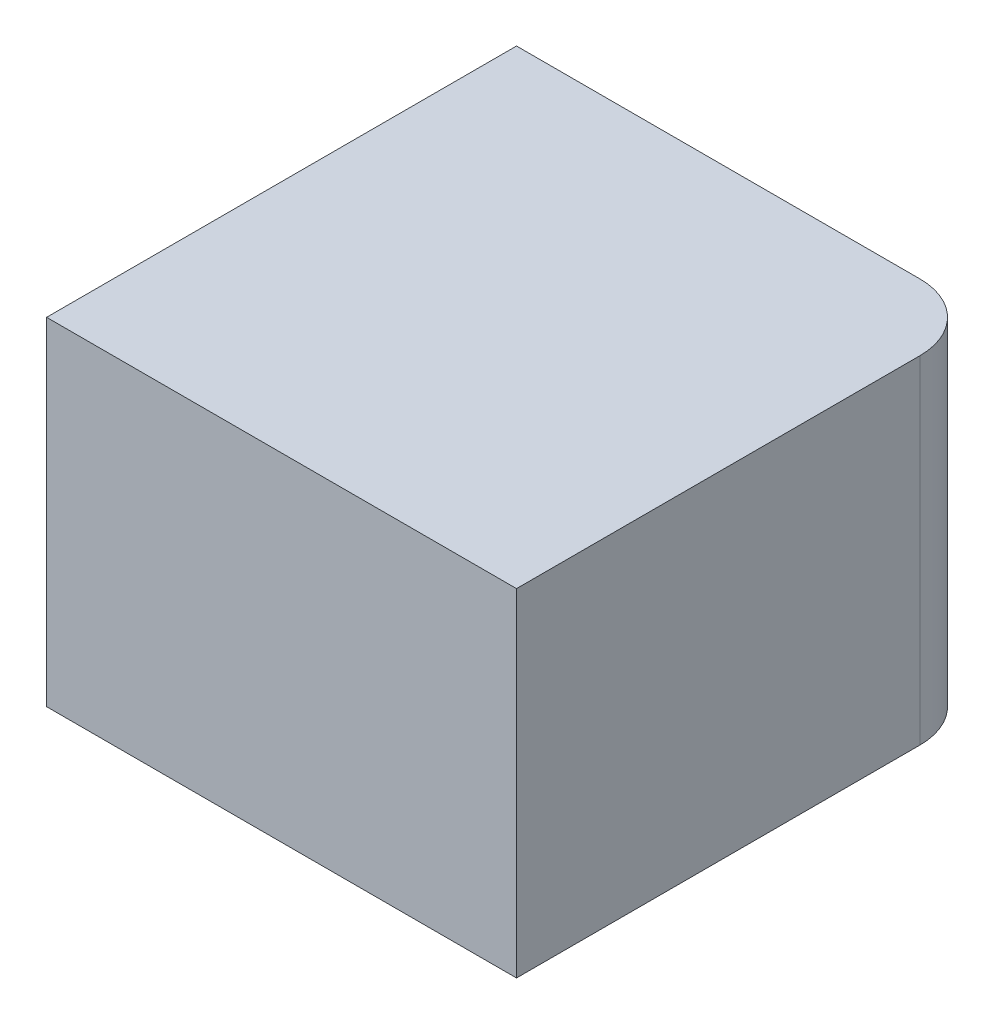
ISO-10303-21;
HEADER;
FILE_DESCRIPTION(('STEP AP214'),'2;1');
FILE_NAME('part.step','',(''),(''),'','','');
FILE_SCHEMA(('AUTOMOTIVE_DESIGN { 1 0 10303 214 1 1 1 1 }'));
ENDSEC;
DATA;
#1=APPLICATION_CONTEXT('core data for automotive mechanical design processes');
#2=APPLICATION_PROTOCOL_DEFINITION('international standard','automotive_design',2000,#1);
#3=PRODUCT_CONTEXT('',#1,'mechanical');
#4=PRODUCT('Part','Part','',(#3));
#5=PRODUCT_RELATED_PRODUCT_CATEGORY('part','',(#4));
#6=PRODUCT_DEFINITION_FORMATION('','',#4);
#7=PRODUCT_DEFINITION_CONTEXT('part definition',#1,'design');
#8=PRODUCT_DEFINITION('design','',#6,#7);
#9=PRODUCT_DEFINITION_SHAPE('','',#8);
#10=(LENGTH_UNIT() NAMED_UNIT(*) SI_UNIT(.MILLI.,.METRE.));
#11=(NAMED_UNIT(*) PLANE_ANGLE_UNIT() SI_UNIT($,.RADIAN.));
#12=(NAMED_UNIT(*) SI_UNIT($,.STERADIAN.) SOLID_ANGLE_UNIT());
#13=UNCERTAINTY_MEASURE_WITH_UNIT(LENGTH_MEASURE(1.E-05),#10,'distance_accuracy_value','');
#14=(GEOMETRIC_REPRESENTATION_CONTEXT(3) GLOBAL_UNCERTAINTY_ASSIGNED_CONTEXT((#13)) GLOBAL_UNIT_ASSIGNED_CONTEXT((#10,
#11,#12)) REPRESENTATION_CONTEXT('',''));
#15=CARTESIAN_POINT('',(0.,0.,0.));
#16=DIRECTION('',(0.,0.,1.));
#17=DIRECTION('',(1.,0.,0.));
#18=AXIS2_PLACEMENT_3D('',#15,#16,#17);
#19=CARTESIAN_POINT('',(41.8191646927066,26.6,-16.3));
#20=DIRECTION('',(0.,0.,1.));
#21=DIRECTION('',(1.,0.,0.));
#22=AXIS2_PLACEMENT_3D('',#19,#20,#21);
#23=PLANE('',#22);
#24=DIRECTION('',(-1.,0.,0.));
#25=VECTOR('',#24,1.);
#26=CARTESIAN_POINT('',(41.8191646927066,20.5,-16.3));
#27=LINE('',#26,#25);
#28=CARTESIAN_POINT('',(49.1191646927066,20.5,-16.3));
#29=VERTEX_POINT('',#28);
#30=CARTESIAN_POINT('',(41.8191646927066,20.5,-16.3));
#31=VERTEX_POINT('',#30);
#32=EDGE_CURVE('E118',#29,#31,#27,.T.);
#33=ORIENTED_EDGE('',*,*,#32,.T.);
#34=DIRECTION('',(0.,-1.,0.));
#35=VECTOR('',#34,1.);
#36=CARTESIAN_POINT('',(41.8191646927066,26.6,-16.3));
#37=LINE('',#36,#35);
#38=CARTESIAN_POINT('',(41.8191646927066,26.6,-16.3));
#39=VERTEX_POINT('',#38);
#40=EDGE_CURVE('E111',#39,#31,#37,.T.);
#41=ORIENTED_EDGE('',*,*,#40,.F.);
#42=DIRECTION('',(-1.,0.,0.));
#43=VECTOR('',#42,1.);
#44=CARTESIAN_POINT('',(41.8191646927066,26.6,-16.3));
#45=LINE('',#44,#43);
#46=CARTESIAN_POINT('',(49.1191646927066,26.6,-16.3));
#47=VERTEX_POINT('',#46);
#48=EDGE_CURVE('E56',#47,#39,#45,.T.);
#49=ORIENTED_EDGE('',*,*,#48,.F.);
#50=DIRECTION('',(0.,-1.,0.));
#51=VECTOR('',#50,1.);
#52=CARTESIAN_POINT('',(49.1191646927066,26.6,-16.3));
#53=LINE('',#52,#51);
#54=EDGE_CURVE('E107',#47,#29,#53,.T.);
#55=ORIENTED_EDGE('',*,*,#54,.T.);
#56=EDGE_LOOP('',(#33,#41,#49,#55));
#57=FACE_BOUND('',#56,.T.);
#58=ADVANCED_FACE('F37',(#57),#23,.F.);
#59=CARTESIAN_POINT('',(49.1191646927066,26.6,-15.1));
#60=DIRECTION('',(0.,-1.,0.));
#61=DIRECTION('',(0.,0.,-1.));
#62=AXIS2_PLACEMENT_3D('',#59,#60,#61);
#63=CYLINDRICAL_SURFACE('',#62,1.2);
#64=CARTESIAN_POINT('',(49.1191646927066,20.5,-15.1));
#65=DIRECTION('',(0.,1.,0.));
#66=DIRECTION('',(0.,0.,1.));
#67=AXIS2_PLACEMENT_3D('',#64,#65,#66);
#68=CIRCLE('',#67,1.2);
#69=CARTESIAN_POINT('',(50.3191646927066,20.5,-15.1));
#70=VERTEX_POINT('',#69);
#71=EDGE_CURVE('E75',#70,#29,#68,.T.);
#72=ORIENTED_EDGE('',*,*,#71,.T.);
#73=ORIENTED_EDGE('',*,*,#54,.F.);
#74=CARTESIAN_POINT('',(49.1191646927066,26.6,-15.1));
#75=DIRECTION('',(0.,1.,0.));
#76=DIRECTION('',(0.,0.,1.));
#77=AXIS2_PLACEMENT_3D('',#74,#75,#76);
#78=CIRCLE('',#77,1.2);
#79=CARTESIAN_POINT('',(50.3191646927066,26.6,-15.1));
#80=VERTEX_POINT('',#79);
#81=EDGE_CURVE('E98',#80,#47,#78,.T.);
#82=ORIENTED_EDGE('',*,*,#81,.F.);
#83=DIRECTION('',(0.,-1.,0.));
#84=VECTOR('',#83,1.);
#85=CARTESIAN_POINT('',(50.3191646927066,26.6,-15.1));
#86=LINE('',#85,#84);
#87=EDGE_CURVE('E102',#80,#70,#86,.T.);
#88=ORIENTED_EDGE('',*,*,#87,.T.);
#89=EDGE_LOOP('',(#72,#73,#82,#88));
#90=FACE_BOUND('',#89,.T.);
#91=ADVANCED_FACE('F109',(#90),#63,.T.);
#92=CARTESIAN_POINT('',(41.8191646927066,26.6,-16.3));
#93=DIRECTION('',(1.,0.,0.));
#94=DIRECTION('',(0.,0.,-1.));
#95=AXIS2_PLACEMENT_3D('',#92,#93,#94);
#96=PLANE('',#95);
#97=ORIENTED_EDGE('',*,*,#40,.T.);
#98=DIRECTION('',(0.,0.,1.));
#99=VECTOR('',#98,1.);
#100=CARTESIAN_POINT('',(41.8191646927066,20.5,-16.3));
#101=LINE('',#100,#99);
#102=CARTESIAN_POINT('',(41.8191646927066,20.5,-7.80000000000001));
#103=VERTEX_POINT('',#102);
#104=EDGE_CURVE('E12',#31,#103,#101,.T.);
#105=ORIENTED_EDGE('',*,*,#104,.T.);
#106=DIRECTION('',(0.,-1.,0.));
#107=VECTOR('',#106,1.);
#108=CARTESIAN_POINT('',(41.8191646927066,26.6,-7.80000000000001));
#109=LINE('',#108,#107);
#110=CARTESIAN_POINT('',(41.8191646927066,26.6,-7.80000000000001));
#111=VERTEX_POINT('',#110);
#112=EDGE_CURVE('E41',#111,#103,#109,.T.);
#113=ORIENTED_EDGE('',*,*,#112,.F.);
#114=DIRECTION('',(0.,0.,1.));
#115=VECTOR('',#114,1.);
#116=CARTESIAN_POINT('',(41.8191646927066,26.6,-16.3));
#117=LINE('',#116,#115);
#118=EDGE_CURVE('E120',#39,#111,#117,.T.);
#119=ORIENTED_EDGE('',*,*,#118,.F.);
#120=EDGE_LOOP('',(#97,#105,#113,#119));
#121=FACE_BOUND('',#120,.T.);
#122=ADVANCED_FACE('F39',(#121),#96,.F.);
#123=CARTESIAN_POINT('',(49.1191646927066,26.6,-15.1));
#124=DIRECTION('',(0.,1.,0.));
#125=DIRECTION('',(0.,0.,1.));
#126=AXIS2_PLACEMENT_3D('',#123,#124,#125);
#127=PLANE('',#126);
#128=ORIENTED_EDGE('',*,*,#118,.T.);
#129=DIRECTION('',(1.,0.,0.));
#130=VECTOR('',#129,1.);
#131=CARTESIAN_POINT('',(41.8191646927066,26.6,-7.80000000000001));
#132=LINE('',#131,#130);
#133=CARTESIAN_POINT('',(50.3191646927066,26.6,-7.80000000000001));
#134=VERTEX_POINT('',#133);
#135=EDGE_CURVE('E90',#111,#134,#132,.T.);
#136=ORIENTED_EDGE('',*,*,#135,.T.);
#137=DIRECTION('',(0.,0.,-1.));
#138=VECTOR('',#137,1.);
#139=CARTESIAN_POINT('',(50.3191646927066,26.6,-15.1));
#140=LINE('',#139,#138);
#141=EDGE_CURVE('E94',#134,#80,#140,.T.);
#142=ORIENTED_EDGE('',*,*,#141,.T.);
#143=ORIENTED_EDGE('',*,*,#81,.T.);
#144=ORIENTED_EDGE('',*,*,#48,.T.);
#145=EDGE_LOOP('',(#128,#136,#142,#143,#144));
#146=FACE_BOUND('',#145,.T.);
#147=ADVANCED_FACE('F96',(#146),#127,.T.);
#148=CARTESIAN_POINT('',(50.3191646927066,26.6,-15.1));
#149=DIRECTION('',(-1.,0.,0.));
#150=DIRECTION('',(0.,0.,1.));
#151=AXIS2_PLACEMENT_3D('',#148,#149,#150);
#152=PLANE('',#151);
#153=DIRECTION('',(0.,0.,-1.));
#154=VECTOR('',#153,1.);
#155=CARTESIAN_POINT('',(50.3191646927066,20.5,-15.1));
#156=LINE('',#155,#154);
#157=CARTESIAN_POINT('',(50.3191646927066,20.5,-7.80000000000001));
#158=VERTEX_POINT('',#157);
#159=EDGE_CURVE('E105',#158,#70,#156,.T.);
#160=ORIENTED_EDGE('',*,*,#159,.T.);
#161=ORIENTED_EDGE('',*,*,#87,.F.);
#162=ORIENTED_EDGE('',*,*,#141,.F.);
#163=DIRECTION('',(0.,-1.,0.));
#164=VECTOR('',#163,1.);
#165=CARTESIAN_POINT('',(50.3191646927066,26.6,-7.80000000000001));
#166=LINE('',#165,#164);
#167=EDGE_CURVE('E106',#134,#158,#166,.T.);
#168=ORIENTED_EDGE('',*,*,#167,.T.);
#169=EDGE_LOOP('',(#160,#161,#162,#168));
#170=FACE_BOUND('',#169,.T.);
#171=ADVANCED_FACE('F103',(#170),#152,.F.);
#172=CARTESIAN_POINT('',(41.8191646927066,26.6,-7.80000000000001));
#173=DIRECTION('',(0.,0.,-1.));
#174=DIRECTION('',(-1.,0.,0.));
#175=AXIS2_PLACEMENT_3D('',#172,#173,#174);
#176=PLANE('',#175);
#177=ORIENTED_EDGE('',*,*,#112,.T.);
#178=DIRECTION('',(1.,0.,0.));
#179=VECTOR('',#178,1.);
#180=CARTESIAN_POINT('',(41.8191646927066,20.5,-7.80000000000001));
#181=LINE('',#180,#179);
#182=EDGE_CURVE('E47',#103,#158,#181,.T.);
#183=ORIENTED_EDGE('',*,*,#182,.T.);
#184=ORIENTED_EDGE('',*,*,#167,.F.);
#185=ORIENTED_EDGE('',*,*,#135,.F.);
#186=EDGE_LOOP('',(#177,#183,#184,#185));
#187=FACE_BOUND('',#186,.T.);
#188=ADVANCED_FACE('F124',(#187),#176,.F.);
#189=CARTESIAN_POINT('',(49.1191646927066,20.5,-15.1));
#190=DIRECTION('',(0.,1.,0.));
#191=DIRECTION('',(0.,0.,1.));
#192=AXIS2_PLACEMENT_3D('',#189,#190,#191);
#193=PLANE('',#192);
#194=ORIENTED_EDGE('',*,*,#182,.F.);
#195=ORIENTED_EDGE('',*,*,#104,.F.);
#196=ORIENTED_EDGE('',*,*,#32,.F.);
#197=ORIENTED_EDGE('',*,*,#71,.F.);
#198=ORIENTED_EDGE('',*,*,#159,.F.);
#199=EDGE_LOOP('',(#194,#195,#196,#197,#198));
#200=FACE_BOUND('',#199,.T.);
#201=ADVANCED_FACE('F127',(#200),#193,.F.);
#202=CLOSED_SHELL('',(#58,#91,#122,#147,#171,#188,#201));
#203=MANIFOLD_SOLID_BREP('B2',#202);
#204=ADVANCED_BREP_SHAPE_REPRESENTATION('',(#18,#203),#14);
#205=SHAPE_DEFINITION_REPRESENTATION(#9,#204);
ENDSEC;
END-ISO-10303-21;
